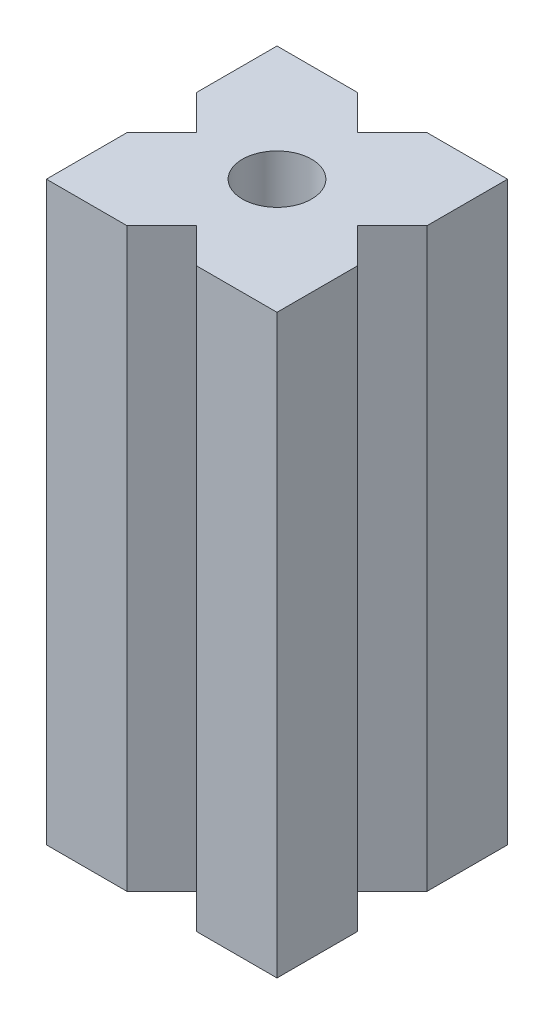
ISO-10303-21;
HEADER;
FILE_DESCRIPTION(('STEP AP214'),'2;1');
FILE_NAME('part.step','',(''),(''),'','','');
FILE_SCHEMA(('AUTOMOTIVE_DESIGN { 1 0 10303 214 1 1 1 1 }'));
ENDSEC;
DATA;
#1=APPLICATION_CONTEXT('core data for automotive mechanical design processes');
#2=APPLICATION_PROTOCOL_DEFINITION('international standard','automotive_design',2000,#1);
#3=PRODUCT_CONTEXT('',#1,'mechanical');
#4=PRODUCT('Part','Part','',(#3));
#5=PRODUCT_RELATED_PRODUCT_CATEGORY('part','',(#4));
#6=PRODUCT_DEFINITION_FORMATION('','',#4);
#7=PRODUCT_DEFINITION_CONTEXT('part definition',#1,'design');
#8=PRODUCT_DEFINITION('design','',#6,#7);
#9=PRODUCT_DEFINITION_SHAPE('','',#8);
#10=(LENGTH_UNIT() NAMED_UNIT(*) SI_UNIT(.MILLI.,.METRE.));
#11=(NAMED_UNIT(*) PLANE_ANGLE_UNIT() SI_UNIT($,.RADIAN.));
#12=(NAMED_UNIT(*) SI_UNIT($,.STERADIAN.) SOLID_ANGLE_UNIT());
#13=UNCERTAINTY_MEASURE_WITH_UNIT(LENGTH_MEASURE(1.E-05),#10,'distance_accuracy_value','');
#14=(GEOMETRIC_REPRESENTATION_CONTEXT(3) GLOBAL_UNCERTAINTY_ASSIGNED_CONTEXT((#13)) GLOBAL_UNIT_ASSIGNED_CONTEXT((#10,
#11,#12)) REPRESENTATION_CONTEXT('',''));
#15=CARTESIAN_POINT('',(0.,0.,0.));
#16=DIRECTION('',(0.,0.,1.));
#17=DIRECTION('',(1.,0.,0.));
#18=AXIS2_PLACEMENT_3D('',#15,#16,#17);
#19=CARTESIAN_POINT('',(-10.,25.,10.));
#20=DIRECTION('',(1.,0.,0.));
#21=DIRECTION('',(0.,0.,-1.));
#22=AXIS2_PLACEMENT_3D('',#19,#20,#21);
#23=PLANE('',#22);
#24=DIRECTION('',(0.,0.,1.));
#25=VECTOR('',#24,1.);
#26=CARTESIAN_POINT('',(-10.,25.,10.));
#27=LINE('',#26,#25);
#28=CARTESIAN_POINT('',(-9.99999999999999,25.,3.));
#29=VERTEX_POINT('',#28);
#30=CARTESIAN_POINT('',(-10.,25.,10.));
#31=VERTEX_POINT('',#30);
#32=EDGE_CURVE('E189',#29,#31,#27,.T.);
#33=ORIENTED_EDGE('',*,*,#32,.F.);
#34=DIRECTION('',(0.,1.,0.));
#35=VECTOR('',#34,1.);
#36=CARTESIAN_POINT('',(-9.99999999999999,-25.,3.));
#37=LINE('',#36,#35);
#38=CARTESIAN_POINT('',(-9.99999999999999,-25.,3.));
#39=VERTEX_POINT('',#38);
#40=EDGE_CURVE('E239',#39,#29,#37,.T.);
#41=ORIENTED_EDGE('',*,*,#40,.F.);
#42=DIRECTION('',(0.,0.,1.));
#43=VECTOR('',#42,1.);
#44=CARTESIAN_POINT('',(-10.,-25.,10.));
#45=LINE('',#44,#43);
#46=CARTESIAN_POINT('',(-10.,-25.,10.));
#47=VERTEX_POINT('',#46);
#48=EDGE_CURVE('E307',#39,#47,#45,.T.);
#49=ORIENTED_EDGE('',*,*,#48,.T.);
#50=DIRECTION('',(0.,-1.,0.));
#51=VECTOR('',#50,1.);
#52=CARTESIAN_POINT('',(-10.,25.,10.));
#53=LINE('',#52,#51);
#54=EDGE_CURVE('E11',#31,#47,#53,.T.);
#55=ORIENTED_EDGE('',*,*,#54,.F.);
#56=EDGE_LOOP('',(#33,#41,#49,#55));
#57=FACE_BOUND('',#56,.T.);
#58=ADVANCED_FACE('F41',(#57),#23,.F.);
#59=CARTESIAN_POINT('',(-10.,25.,10.));
#60=DIRECTION('',(0.,0.,-1.));
#61=DIRECTION('',(-1.,0.,0.));
#62=AXIS2_PLACEMENT_3D('',#59,#60,#61);
#63=PLANE('',#62);
#64=DIRECTION('',(1.,0.,0.));
#65=VECTOR('',#64,1.);
#66=CARTESIAN_POINT('',(-10.,-25.,10.));
#67=LINE('',#66,#65);
#68=CARTESIAN_POINT('',(-3.,-25.,10.));
#69=VERTEX_POINT('',#68);
#70=EDGE_CURVE('E308',#47,#69,#67,.T.);
#71=ORIENTED_EDGE('',*,*,#70,.T.);
#72=DIRECTION('',(0.,1.,0.));
#73=VECTOR('',#72,1.);
#74=CARTESIAN_POINT('',(-3.,-25.,10.));
#75=LINE('',#74,#73);
#76=CARTESIAN_POINT('',(-3.,25.,10.));
#77=VERTEX_POINT('',#76);
#78=EDGE_CURVE('E276',#69,#77,#75,.T.);
#79=ORIENTED_EDGE('',*,*,#78,.T.);
#80=DIRECTION('',(1.,0.,0.));
#81=VECTOR('',#80,1.);
#82=CARTESIAN_POINT('',(-10.,25.,10.));
#83=LINE('',#82,#81);
#84=EDGE_CURVE('E296',#31,#77,#83,.T.);
#85=ORIENTED_EDGE('',*,*,#84,.F.);
#86=ORIENTED_EDGE('',*,*,#54,.T.);
#87=EDGE_LOOP('',(#71,#79,#85,#86));
#88=FACE_BOUND('',#87,.T.);
#89=ADVANCED_FACE('F331',(#88),#63,.F.);
#90=CARTESIAN_POINT('',(10.,25.,10.));
#91=DIRECTION('',(-1.,0.,0.));
#92=DIRECTION('',(0.,0.,1.));
#93=AXIS2_PLACEMENT_3D('',#90,#91,#92);
#94=PLANE('',#93);
#95=DIRECTION('',(0.,0.,-1.));
#96=VECTOR('',#95,1.);
#97=CARTESIAN_POINT('',(10.,-25.,10.));
#98=LINE('',#97,#96);
#99=CARTESIAN_POINT('',(10.,-25.,10.));
#100=VERTEX_POINT('',#99);
#101=CARTESIAN_POINT('',(9.99999999999999,-25.,3.));
#102=VERTEX_POINT('',#101);
#103=EDGE_CURVE('E182',#100,#102,#98,.T.);
#104=ORIENTED_EDGE('',*,*,#103,.T.);
#105=DIRECTION('',(0.,1.,0.));
#106=VECTOR('',#105,1.);
#107=CARTESIAN_POINT('',(9.99999999999999,-25.,3.));
#108=LINE('',#107,#106);
#109=CARTESIAN_POINT('',(9.99999999999999,25.,3.));
#110=VERTEX_POINT('',#109);
#111=EDGE_CURVE('E242',#102,#110,#108,.T.);
#112=ORIENTED_EDGE('',*,*,#111,.T.);
#113=DIRECTION('',(0.,0.,-1.));
#114=VECTOR('',#113,1.);
#115=CARTESIAN_POINT('',(10.,25.,10.));
#116=LINE('',#115,#114);
#117=CARTESIAN_POINT('',(10.,25.,10.));
#118=VERTEX_POINT('',#117);
#119=EDGE_CURVE('E215',#118,#110,#116,.T.);
#120=ORIENTED_EDGE('',*,*,#119,.F.);
#121=DIRECTION('',(0.,-1.,0.));
#122=VECTOR('',#121,1.);
#123=CARTESIAN_POINT('',(10.,25.,10.));
#124=LINE('',#123,#122);
#125=EDGE_CURVE('E50',#118,#100,#124,.T.);
#126=ORIENTED_EDGE('',*,*,#125,.T.);
#127=EDGE_LOOP('',(#104,#112,#120,#126));
#128=FACE_BOUND('',#127,.T.);
#129=ADVANCED_FACE('F212',(#128),#94,.F.);
#130=CARTESIAN_POINT('',(-10.,25.,-10.));
#131=DIRECTION('',(0.,0.,1.));
#132=DIRECTION('',(1.,0.,0.));
#133=AXIS2_PLACEMENT_3D('',#130,#131,#132);
#134=PLANE('',#133);
#135=DIRECTION('',(-1.,0.,0.));
#136=VECTOR('',#135,1.);
#137=CARTESIAN_POINT('',(-10.,-25.,-10.));
#138=LINE('',#137,#136);
#139=CARTESIAN_POINT('',(10.,-25.,-10.));
#140=VERTEX_POINT('',#139);
#141=CARTESIAN_POINT('',(3.,-25.,-10.));
#142=VERTEX_POINT('',#141);
#143=EDGE_CURVE('E181',#140,#142,#138,.T.);
#144=ORIENTED_EDGE('',*,*,#143,.T.);
#145=DIRECTION('',(0.,1.,0.));
#146=VECTOR('',#145,1.);
#147=CARTESIAN_POINT('',(3.,-25.,-10.));
#148=LINE('',#147,#146);
#149=CARTESIAN_POINT('',(3.,25.,-10.));
#150=VERTEX_POINT('',#149);
#151=EDGE_CURVE('E337',#142,#150,#148,.T.);
#152=ORIENTED_EDGE('',*,*,#151,.T.);
#153=DIRECTION('',(-1.,0.,0.));
#154=VECTOR('',#153,1.);
#155=CARTESIAN_POINT('',(-10.,25.,-10.));
#156=LINE('',#155,#154);
#157=CARTESIAN_POINT('',(10.,25.,-10.));
#158=VERTEX_POINT('',#157);
#159=EDGE_CURVE('E200',#158,#150,#156,.T.);
#160=ORIENTED_EDGE('',*,*,#159,.F.);
#161=DIRECTION('',(0.,-1.,0.));
#162=VECTOR('',#161,1.);
#163=CARTESIAN_POINT('',(10.,25.,-10.));
#164=LINE('',#163,#162);
#165=EDGE_CURVE('E199',#158,#140,#164,.T.);
#166=ORIENTED_EDGE('',*,*,#165,.T.);
#167=EDGE_LOOP('',(#144,#152,#160,#166));
#168=FACE_BOUND('',#167,.T.);
#169=ADVANCED_FACE('F382',(#168),#134,.F.);
#170=CARTESIAN_POINT('',(-10.,-25.,-10.));
#171=VERTEX_POINT('',#170);
#172=CARTESIAN_POINT('',(-10.,-25.,-3.00000000000001));
#173=VERTEX_POINT('',#172);
#174=EDGE_CURVE('E179',#171,#173,#45,.T.);
#175=ORIENTED_EDGE('',*,*,#174,.T.);
#176=DIRECTION('',(0.,1.,0.));
#177=VECTOR('',#176,1.);
#178=CARTESIAN_POINT('',(-9.99999999999999,-25.,-3.));
#179=LINE('',#178,#177);
#180=CARTESIAN_POINT('',(-9.99999999999999,25.,-3.));
#181=VERTEX_POINT('',#180);
#182=EDGE_CURVE('E263',#173,#181,#179,.T.);
#183=ORIENTED_EDGE('',*,*,#182,.T.);
#184=CARTESIAN_POINT('',(-10.,25.,-10.));
#185=VERTEX_POINT('',#184);
#186=EDGE_CURVE('E291',#185,#181,#27,.T.);
#187=ORIENTED_EDGE('',*,*,#186,.F.);
#188=DIRECTION('',(0.,-1.,0.));
#189=VECTOR('',#188,1.);
#190=CARTESIAN_POINT('',(-10.,25.,-10.));
#191=LINE('',#190,#189);
#192=EDGE_CURVE('E196',#185,#171,#191,.T.);
#193=ORIENTED_EDGE('',*,*,#192,.T.);
#194=EDGE_LOOP('',(#175,#183,#187,#193));
#195=FACE_BOUND('',#194,.T.);
#196=ADVANCED_FACE('F43',(#195),#23,.F.);
#197=CARTESIAN_POINT('',(3.,25.,10.));
#198=VERTEX_POINT('',#197);
#199=EDGE_CURVE('E295',#198,#118,#83,.T.);
#200=ORIENTED_EDGE('',*,*,#199,.F.);
#201=DIRECTION('',(0.,1.,0.));
#202=VECTOR('',#201,1.);
#203=CARTESIAN_POINT('',(3.,-25.,10.));
#204=LINE('',#203,#202);
#205=CARTESIAN_POINT('',(3.,-25.,10.));
#206=VERTEX_POINT('',#205);
#207=EDGE_CURVE('E286',#206,#198,#204,.T.);
#208=ORIENTED_EDGE('',*,*,#207,.F.);
#209=EDGE_CURVE('E220',#206,#100,#67,.T.);
#210=ORIENTED_EDGE('',*,*,#209,.T.);
#211=ORIENTED_EDGE('',*,*,#125,.F.);
#212=EDGE_LOOP('',(#200,#208,#210,#211));
#213=FACE_BOUND('',#212,.T.);
#214=ADVANCED_FACE('F320',(#213),#63,.F.);
#215=CARTESIAN_POINT('',(9.99999999999999,25.,-3.));
#216=VERTEX_POINT('',#215);
#217=EDGE_CURVE('E300',#216,#158,#116,.T.);
#218=ORIENTED_EDGE('',*,*,#217,.F.);
#219=DIRECTION('',(0.,1.,0.));
#220=VECTOR('',#219,1.);
#221=CARTESIAN_POINT('',(9.99999999999999,-25.,-3.));
#222=LINE('',#221,#220);
#223=CARTESIAN_POINT('',(9.99999999999999,-25.,-3.));
#224=VERTEX_POINT('',#223);
#225=EDGE_CURVE('E225',#224,#216,#222,.T.);
#226=ORIENTED_EDGE('',*,*,#225,.F.);
#227=EDGE_CURVE('E192',#224,#140,#98,.T.);
#228=ORIENTED_EDGE('',*,*,#227,.T.);
#229=ORIENTED_EDGE('',*,*,#165,.F.);
#230=EDGE_LOOP('',(#218,#226,#228,#229));
#231=FACE_BOUND('',#230,.T.);
#232=ADVANCED_FACE('F380',(#231),#94,.F.);
#233=CARTESIAN_POINT('',(-3.,25.,-10.));
#234=VERTEX_POINT('',#233);
#235=EDGE_CURVE('E172',#234,#185,#156,.T.);
#236=ORIENTED_EDGE('',*,*,#235,.F.);
#237=DIRECTION('',(0.,1.,0.));
#238=VECTOR('',#237,1.);
#239=CARTESIAN_POINT('',(-3.,-25.,-10.));
#240=LINE('',#239,#238);
#241=CARTESIAN_POINT('',(-3.,-25.,-10.));
#242=VERTEX_POINT('',#241);
#243=EDGE_CURVE('E158',#242,#234,#240,.T.);
#244=ORIENTED_EDGE('',*,*,#243,.F.);
#245=EDGE_CURVE('E170',#242,#171,#138,.T.);
#246=ORIENTED_EDGE('',*,*,#245,.T.);
#247=ORIENTED_EDGE('',*,*,#192,.F.);
#248=EDGE_LOOP('',(#236,#244,#246,#247));
#249=FACE_BOUND('',#248,.T.);
#250=ADVANCED_FACE('F168',(#249),#134,.F.);
#251=CARTESIAN_POINT('',(0.,25.,0.));
#252=DIRECTION('',(0.,-1.,0.));
#253=DIRECTION('',(0.,0.,-1.));
#254=AXIS2_PLACEMENT_3D('',#251,#252,#253);
#255=PLANE('',#254);
#256=CARTESIAN_POINT('',(0.,25.,0.));
#257=DIRECTION('',(0.,1.,0.));
#258=DIRECTION('',(0.,0.,1.));
#259=AXIS2_PLACEMENT_3D('',#256,#257,#258);
#260=CIRCLE('',#259,3.);
#261=CARTESIAN_POINT('',(0.,25.,3.));
#262=VERTEX_POINT('',#261);
#263=EDGE_CURVE('E355',#262,#262,#260,.T.);
#264=ORIENTED_EDGE('',*,*,#263,.F.);
#265=EDGE_LOOP('',(#264));
#266=FACE_BOUND('',#265,.T.);
#267=ORIENTED_EDGE('',*,*,#159,.T.);
#268=DIRECTION('',(0.707106781186547,0.,-0.707106781186547));
#269=VECTOR('',#268,1.);
#270=CARTESIAN_POINT('',(3.,25.,-10.));
#271=LINE('',#270,#269);
#272=CARTESIAN_POINT('',(0.,25.,-7.));
#273=VERTEX_POINT('',#272);
#274=EDGE_CURVE('E164',#273,#150,#271,.T.);
#275=ORIENTED_EDGE('',*,*,#274,.F.);
#276=DIRECTION('',(0.707106781186548,0.,0.707106781186547));
#277=VECTOR('',#276,1.);
#278=CARTESIAN_POINT('',(-3.,25.,-10.));
#279=LINE('',#278,#277);
#280=EDGE_CURVE('E244',#234,#273,#279,.T.);
#281=ORIENTED_EDGE('',*,*,#280,.F.);
#282=ORIENTED_EDGE('',*,*,#235,.T.);
#283=ORIENTED_EDGE('',*,*,#186,.T.);
#284=DIRECTION('',(-0.707106781186547,0.,-0.707106781186548));
#285=VECTOR('',#284,1.);
#286=CARTESIAN_POINT('',(-9.99999999999999,25.,-3.));
#287=LINE('',#286,#285);
#288=CARTESIAN_POINT('',(-7.,25.,0.));
#289=VERTEX_POINT('',#288);
#290=EDGE_CURVE('E251',#289,#181,#287,.T.);
#291=ORIENTED_EDGE('',*,*,#290,.F.);
#292=DIRECTION('',(0.707106781186547,0.,-0.707106781186548));
#293=VECTOR('',#292,1.);
#294=CARTESIAN_POINT('',(-9.99999999999999,25.,3.));
#295=LINE('',#294,#293);
#296=EDGE_CURVE('E255',#29,#289,#295,.T.);
#297=ORIENTED_EDGE('',*,*,#296,.F.);
#298=ORIENTED_EDGE('',*,*,#32,.T.);
#299=ORIENTED_EDGE('',*,*,#84,.T.);
#300=DIRECTION('',(-0.707106781186547,0.,0.707106781186547));
#301=VECTOR('',#300,1.);
#302=CARTESIAN_POINT('',(-3.,25.,10.));
#303=LINE('',#302,#301);
#304=CARTESIAN_POINT('',(0.,25.,7.));
#305=VERTEX_POINT('',#304);
#306=EDGE_CURVE('E277',#305,#77,#303,.T.);
#307=ORIENTED_EDGE('',*,*,#306,.F.);
#308=DIRECTION('',(-0.707106781186547,0.,-0.707106781186547));
#309=VECTOR('',#308,1.);
#310=CARTESIAN_POINT('',(3.,25.,10.));
#311=LINE('',#310,#309);
#312=EDGE_CURVE('E273',#198,#305,#311,.T.);
#313=ORIENTED_EDGE('',*,*,#312,.F.);
#314=ORIENTED_EDGE('',*,*,#199,.T.);
#315=ORIENTED_EDGE('',*,*,#119,.T.);
#316=DIRECTION('',(0.707106781186547,0.,0.707106781186548));
#317=VECTOR('',#316,1.);
#318=CARTESIAN_POINT('',(9.99999999999999,25.,3.));
#319=LINE('',#318,#317);
#320=CARTESIAN_POINT('',(7.,25.,0.));
#321=VERTEX_POINT('',#320);
#322=EDGE_CURVE('E232',#321,#110,#319,.T.);
#323=ORIENTED_EDGE('',*,*,#322,.F.);
#324=DIRECTION('',(-0.707106781186547,0.,0.707106781186548));
#325=VECTOR('',#324,1.);
#326=CARTESIAN_POINT('',(9.99999999999999,25.,-3.));
#327=LINE('',#326,#325);
#328=EDGE_CURVE('E235',#216,#321,#327,.T.);
#329=ORIENTED_EDGE('',*,*,#328,.F.);
#330=ORIENTED_EDGE('',*,*,#217,.T.);
#331=EDGE_LOOP('',(#267,#275,#281,#282,#283,#291,#297,#298,#299,#307,#313,#314,#315,#323,#329,#330));
#332=FACE_BOUND('',#331,.T.);
#333=ADVANCED_FACE('F327',(#266,#332),#255,.F.);
#334=CARTESIAN_POINT('',(0.,-25.,0.));
#335=DIRECTION('',(0.,-1.,0.));
#336=DIRECTION('',(0.,0.,-1.));
#337=AXIS2_PLACEMENT_3D('',#334,#335,#336);
#338=PLANE('',#337);
#339=CARTESIAN_POINT('',(0.,-25.,0.));
#340=DIRECTION('',(0.,1.,0.));
#341=DIRECTION('',(0.,0.,1.));
#342=AXIS2_PLACEMENT_3D('',#339,#340,#341);
#343=CIRCLE('',#342,3.);
#344=CARTESIAN_POINT('',(0.,-25.,3.));
#345=VERTEX_POINT('',#344);
#346=EDGE_CURVE('E280',#345,#345,#343,.T.);
#347=ORIENTED_EDGE('',*,*,#346,.T.);
#348=EDGE_LOOP('',(#347));
#349=FACE_BOUND('',#348,.T.);
#350=DIRECTION('',(0.707106781186547,0.,-0.707106781186547));
#351=VECTOR('',#350,1.);
#352=CARTESIAN_POINT('',(3.,-25.,-10.));
#353=LINE('',#352,#351);
#354=CARTESIAN_POINT('',(0.,-25.,-7.));
#355=VERTEX_POINT('',#354);
#356=EDGE_CURVE('E57',#355,#142,#353,.T.);
#357=ORIENTED_EDGE('',*,*,#356,.T.);
#358=ORIENTED_EDGE('',*,*,#143,.F.);
#359=ORIENTED_EDGE('',*,*,#227,.F.);
#360=DIRECTION('',(-0.707106781186547,0.,0.707106781186548));
#361=VECTOR('',#360,1.);
#362=CARTESIAN_POINT('',(9.99999999999999,-25.,-3.));
#363=LINE('',#362,#361);
#364=CARTESIAN_POINT('',(7.,-25.,0.));
#365=VERTEX_POINT('',#364);
#366=EDGE_CURVE('E223',#224,#365,#363,.T.);
#367=ORIENTED_EDGE('',*,*,#366,.T.);
#368=DIRECTION('',(0.707106781186547,0.,0.707106781186548));
#369=VECTOR('',#368,1.);
#370=CARTESIAN_POINT('',(9.99999999999999,-25.,3.));
#371=LINE('',#370,#369);
#372=EDGE_CURVE('E65',#365,#102,#371,.T.);
#373=ORIENTED_EDGE('',*,*,#372,.T.);
#374=ORIENTED_EDGE('',*,*,#103,.F.);
#375=ORIENTED_EDGE('',*,*,#209,.F.);
#376=DIRECTION('',(-0.707106781186547,0.,-0.707106781186547));
#377=VECTOR('',#376,1.);
#378=CARTESIAN_POINT('',(3.,-25.,10.));
#379=LINE('',#378,#377);
#380=CARTESIAN_POINT('',(0.,-25.,7.));
#381=VERTEX_POINT('',#380);
#382=EDGE_CURVE('E272',#206,#381,#379,.T.);
#383=ORIENTED_EDGE('',*,*,#382,.T.);
#384=DIRECTION('',(-0.707106781186547,0.,0.707106781186547));
#385=VECTOR('',#384,1.);
#386=CARTESIAN_POINT('',(-3.,-25.,10.));
#387=LINE('',#386,#385);
#388=EDGE_CURVE('E268',#381,#69,#387,.T.);
#389=ORIENTED_EDGE('',*,*,#388,.T.);
#390=ORIENTED_EDGE('',*,*,#70,.F.);
#391=ORIENTED_EDGE('',*,*,#48,.F.);
#392=DIRECTION('',(0.707106781186547,0.,-0.707106781186548));
#393=VECTOR('',#392,1.);
#394=CARTESIAN_POINT('',(-9.99999999999999,-25.,3.));
#395=LINE('',#394,#393);
#396=CARTESIAN_POINT('',(-7.,-25.,0.));
#397=VERTEX_POINT('',#396);
#398=EDGE_CURVE('E247',#39,#397,#395,.T.);
#399=ORIENTED_EDGE('',*,*,#398,.T.);
#400=DIRECTION('',(-0.707106781186547,0.,-0.707106781186548));
#401=VECTOR('',#400,1.);
#402=CARTESIAN_POINT('',(-9.99999999999999,-25.,-3.));
#403=LINE('',#402,#401);
#404=EDGE_CURVE('E250',#397,#173,#403,.T.);
#405=ORIENTED_EDGE('',*,*,#404,.T.);
#406=ORIENTED_EDGE('',*,*,#174,.F.);
#407=ORIENTED_EDGE('',*,*,#245,.F.);
#408=DIRECTION('',(0.707106781186548,0.,0.707106781186547));
#409=VECTOR('',#408,1.);
#410=CARTESIAN_POINT('',(-3.,-25.,-10.));
#411=LINE('',#410,#409);
#412=EDGE_CURVE('E154',#242,#355,#411,.T.);
#413=ORIENTED_EDGE('',*,*,#412,.T.);
#414=EDGE_LOOP('',(#357,#358,#359,#367,#373,#374,#375,#383,#389,#390,#391,#399,#405,#406,#407,#413));
#415=FACE_BOUND('',#414,.T.);
#416=ADVANCED_FACE('F176',(#349,#415),#338,.T.);
#417=CARTESIAN_POINT('',(-3.,-25.,10.));
#418=DIRECTION('',(-0.707106781186547,0.,-0.707106781186547));
#419=DIRECTION('',(-0.707106781186548,0.,0.707106781186548));
#420=AXIS2_PLACEMENT_3D('',#417,#418,#419);
#421=PLANE('',#420);
#422=ORIENTED_EDGE('',*,*,#306,.T.);
#423=ORIENTED_EDGE('',*,*,#78,.F.);
#424=ORIENTED_EDGE('',*,*,#388,.F.);
#425=DIRECTION('',(0.,1.,0.));
#426=VECTOR('',#425,1.);
#427=CARTESIAN_POINT('',(0.,-25.,7.));
#428=LINE('',#427,#426);
#429=EDGE_CURVE('E258',#381,#305,#428,.T.);
#430=ORIENTED_EDGE('',*,*,#429,.T.);
#431=EDGE_LOOP('',(#422,#423,#424,#430));
#432=FACE_BOUND('',#431,.T.);
#433=ADVANCED_FACE('F330',(#432),#421,.F.);
#434=CARTESIAN_POINT('',(3.,-25.,10.));
#435=DIRECTION('',(0.707106781186547,0.,-0.707106781186547));
#436=DIRECTION('',(-0.707106781186548,0.,-0.707106781186548));
#437=AXIS2_PLACEMENT_3D('',#434,#435,#436);
#438=PLANE('',#437);
#439=ORIENTED_EDGE('',*,*,#312,.T.);
#440=ORIENTED_EDGE('',*,*,#429,.F.);
#441=ORIENTED_EDGE('',*,*,#382,.F.);
#442=ORIENTED_EDGE('',*,*,#207,.T.);
#443=EDGE_LOOP('',(#439,#440,#441,#442));
#444=FACE_BOUND('',#443,.T.);
#445=ADVANCED_FACE('F323',(#444),#438,.F.);
#446=CARTESIAN_POINT('',(-9.99999999999999,-25.,3.));
#447=DIRECTION('',(0.707106781186548,0.,0.707106781186547));
#448=DIRECTION('',(0.707106781186547,0.,-0.707106781186548));
#449=AXIS2_PLACEMENT_3D('',#446,#447,#448);
#450=PLANE('',#449);
#451=ORIENTED_EDGE('',*,*,#296,.T.);
#452=DIRECTION('',(0.,1.,0.));
#453=VECTOR('',#452,1.);
#454=CARTESIAN_POINT('',(-7.,-25.,0.));
#455=LINE('',#454,#453);
#456=EDGE_CURVE('E254',#397,#289,#455,.T.);
#457=ORIENTED_EDGE('',*,*,#456,.F.);
#458=ORIENTED_EDGE('',*,*,#398,.F.);
#459=ORIENTED_EDGE('',*,*,#40,.T.);
#460=EDGE_LOOP('',(#451,#457,#458,#459));
#461=FACE_BOUND('',#460,.T.);
#462=ADVANCED_FACE('F434',(#461),#450,.F.);
#463=CARTESIAN_POINT('',(-9.99999999999999,-25.,-3.));
#464=DIRECTION('',(0.707106781186548,0.,-0.707106781186547));
#465=DIRECTION('',(-0.707106781186547,0.,-0.707106781186548));
#466=AXIS2_PLACEMENT_3D('',#463,#464,#465);
#467=PLANE('',#466);
#468=ORIENTED_EDGE('',*,*,#290,.T.);
#469=ORIENTED_EDGE('',*,*,#182,.F.);
#470=ORIENTED_EDGE('',*,*,#404,.F.);
#471=ORIENTED_EDGE('',*,*,#456,.T.);
#472=EDGE_LOOP('',(#468,#469,#470,#471));
#473=FACE_BOUND('',#472,.T.);
#474=ADVANCED_FACE('F416',(#473),#467,.F.);
#475=CARTESIAN_POINT('',(9.99999999999999,-25.,3.));
#476=DIRECTION('',(-0.707106781186548,0.,0.707106781186547));
#477=DIRECTION('',(0.707106781186547,0.,0.707106781186548));
#478=AXIS2_PLACEMENT_3D('',#475,#476,#477);
#479=PLANE('',#478);
#480=ORIENTED_EDGE('',*,*,#322,.T.);
#481=ORIENTED_EDGE('',*,*,#111,.F.);
#482=ORIENTED_EDGE('',*,*,#372,.F.);
#483=DIRECTION('',(0.,1.,0.));
#484=VECTOR('',#483,1.);
#485=CARTESIAN_POINT('',(7.,-25.,0.));
#486=LINE('',#485,#484);
#487=EDGE_CURVE('E229',#365,#321,#486,.T.);
#488=ORIENTED_EDGE('',*,*,#487,.T.);
#489=EDGE_LOOP('',(#480,#481,#482,#488));
#490=FACE_BOUND('',#489,.T.);
#491=ADVANCED_FACE('F411',(#490),#479,.F.);
#492=CARTESIAN_POINT('',(9.99999999999999,-25.,-3.));
#493=DIRECTION('',(-0.707106781186548,0.,-0.707106781186547));
#494=DIRECTION('',(-0.707106781186547,0.,0.707106781186548));
#495=AXIS2_PLACEMENT_3D('',#492,#493,#494);
#496=PLANE('',#495);
#497=ORIENTED_EDGE('',*,*,#328,.T.);
#498=ORIENTED_EDGE('',*,*,#487,.F.);
#499=ORIENTED_EDGE('',*,*,#366,.F.);
#500=ORIENTED_EDGE('',*,*,#225,.T.);
#501=EDGE_LOOP('',(#497,#498,#499,#500));
#502=FACE_BOUND('',#501,.T.);
#503=ADVANCED_FACE('F415',(#502),#496,.F.);
#504=CARTESIAN_POINT('',(3.,-25.,-10.));
#505=DIRECTION('',(0.707106781186547,0.,0.707106781186547));
#506=DIRECTION('',(0.707106781186548,0.,-0.707106781186548));
#507=AXIS2_PLACEMENT_3D('',#504,#505,#506);
#508=PLANE('',#507);
#509=ORIENTED_EDGE('',*,*,#274,.T.);
#510=ORIENTED_EDGE('',*,*,#151,.F.);
#511=ORIENTED_EDGE('',*,*,#356,.F.);
#512=DIRECTION('',(0.,1.,0.));
#513=VECTOR('',#512,1.);
#514=CARTESIAN_POINT('',(0.,-25.,-7.));
#515=LINE('',#514,#513);
#516=EDGE_CURVE('E160',#355,#273,#515,.T.);
#517=ORIENTED_EDGE('',*,*,#516,.T.);
#518=EDGE_LOOP('',(#509,#510,#511,#517));
#519=FACE_BOUND('',#518,.T.);
#520=ADVANCED_FACE('F501',(#519),#508,.F.);
#521=CARTESIAN_POINT('',(-3.,-25.,-10.));
#522=DIRECTION('',(-0.707106781186547,0.,0.707106781186548));
#523=DIRECTION('',(0.707106781186548,0.,0.707106781186547));
#524=AXIS2_PLACEMENT_3D('',#521,#522,#523);
#525=PLANE('',#524);
#526=ORIENTED_EDGE('',*,*,#280,.T.);
#527=ORIENTED_EDGE('',*,*,#516,.F.);
#528=ORIENTED_EDGE('',*,*,#412,.F.);
#529=ORIENTED_EDGE('',*,*,#243,.T.);
#530=EDGE_LOOP('',(#526,#527,#528,#529));
#531=FACE_BOUND('',#530,.T.);
#532=ADVANCED_FACE('F157',(#531),#525,.F.);
#533=CARTESIAN_POINT('',(0.,-25.,0.));
#534=DIRECTION('',(0.,1.,0.));
#535=DIRECTION('',(0.,0.,1.));
#536=AXIS2_PLACEMENT_3D('',#533,#534,#535);
#537=CYLINDRICAL_SURFACE('',#536,3.);
#538=ORIENTED_EDGE('',*,*,#346,.F.);
#539=EDGE_LOOP('',(#538));
#540=FACE_BOUND('',#539,.T.);
#541=ORIENTED_EDGE('',*,*,#263,.T.);
#542=EDGE_LOOP('',(#541));
#543=FACE_BOUND('',#542,.T.);
#544=ADVANCED_FACE('F365',(#540,#543),#537,.F.);
#545=CLOSED_SHELL('',(#58,#89,#129,#169,#196,#214,#232,#250,#333,#416,#433,#445,#462,#474,#491,
#503,#520,#532,#544));
#546=MANIFOLD_SOLID_BREP('B2',#545);
#547=ADVANCED_BREP_SHAPE_REPRESENTATION('',(#18,#546),#14);
#548=SHAPE_DEFINITION_REPRESENTATION(#9,#547);
ENDSEC;
END-ISO-10303-21;
